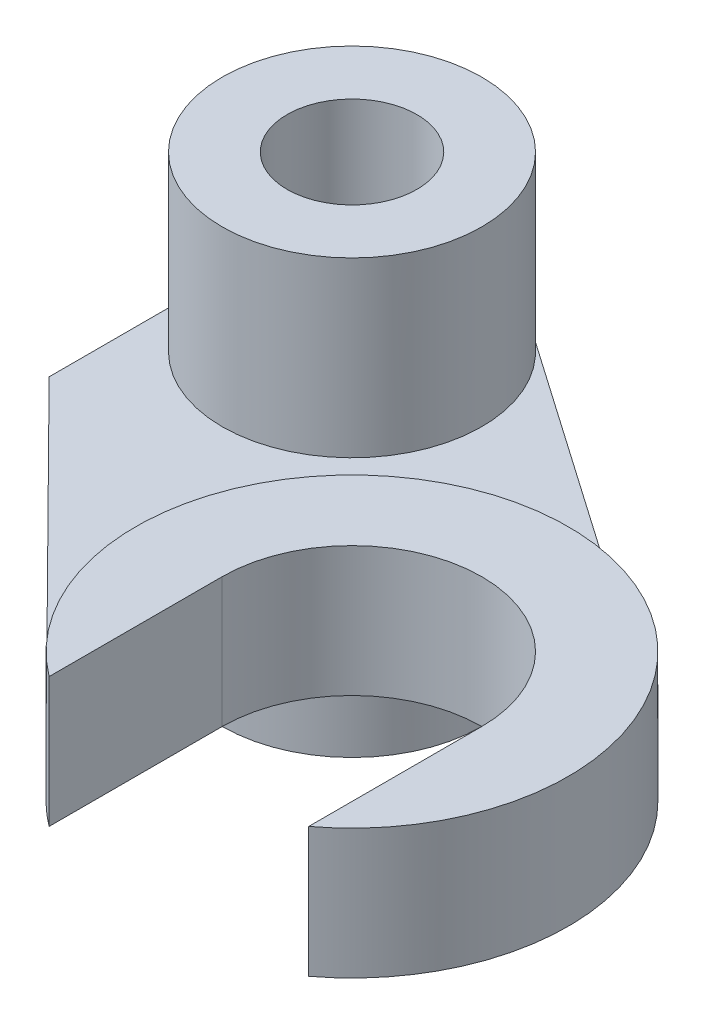
ISO-10303-21;
HEADER;
FILE_DESCRIPTION(('STEP AP214'),'2;1');
FILE_NAME('part.step','',(''),(''),'','','');
FILE_SCHEMA(('AUTOMOTIVE_DESIGN { 1 0 10303 214 1 1 1 1 }'));
ENDSEC;
DATA;
#1=APPLICATION_CONTEXT('core data for automotive mechanical design processes');
#2=APPLICATION_PROTOCOL_DEFINITION('international standard','automotive_design',2000,#1);
#3=PRODUCT_CONTEXT('',#1,'mechanical');
#4=PRODUCT('Part','Part','',(#3));
#5=PRODUCT_RELATED_PRODUCT_CATEGORY('part','',(#4));
#6=PRODUCT_DEFINITION_FORMATION('','',#4);
#7=PRODUCT_DEFINITION_CONTEXT('part definition',#1,'design');
#8=PRODUCT_DEFINITION('design','',#6,#7);
#9=PRODUCT_DEFINITION_SHAPE('','',#8);
#10=(LENGTH_UNIT() NAMED_UNIT(*) SI_UNIT(.MILLI.,.METRE.));
#11=(NAMED_UNIT(*) PLANE_ANGLE_UNIT() SI_UNIT($,.RADIAN.));
#12=(NAMED_UNIT(*) SI_UNIT($,.STERADIAN.) SOLID_ANGLE_UNIT());
#13=UNCERTAINTY_MEASURE_WITH_UNIT(LENGTH_MEASURE(1.E-05),#10,'distance_accuracy_value','');
#14=(GEOMETRIC_REPRESENTATION_CONTEXT(3) GLOBAL_UNCERTAINTY_ASSIGNED_CONTEXT((#13)) GLOBAL_UNIT_ASSIGNED_CONTEXT((#10,
#11,#12)) REPRESENTATION_CONTEXT('',''));
#15=CARTESIAN_POINT('',(0.,0.,0.));
#16=DIRECTION('',(0.,0.,1.));
#17=DIRECTION('',(1.,0.,0.));
#18=AXIS2_PLACEMENT_3D('',#15,#16,#17);
#19=CARTESIAN_POINT('',(0.,10.,0.));
#20=DIRECTION('',(0.,1.,0.));
#21=DIRECTION('',(0.,0.,1.));
#22=AXIS2_PLACEMENT_3D('',#19,#20,#21);
#23=PLANE('',#22);
#24=DIRECTION('',(0.703744946619285,0.,0.710452707861558));
#25=VECTOR('',#24,1.);
#26=CARTESIAN_POINT('',(-35.1413916220169,10.,34.8096030847739));
#27=LINE('',#26,#25);
#28=CARTESIAN_POINT('',(-30.,10.,40.));
#29=VERTEX_POINT('',#28);
#30=CARTESIAN_POINT('',(44.4773646069221,10.,115.187247330964));
#31=VERTEX_POINT('',#30);
#32=EDGE_CURVE('E124',#29,#31,#27,.T.);
#33=ORIENTED_EDGE('',*,*,#32,.T.);
#34=CARTESIAN_POINT('',(80.,10.,80.));
#35=DIRECTION('',(0.,1.,0.));
#36=DIRECTION('',(0.,0.,1.));
#37=AXIS2_PLACEMENT_3D('',#34,#35,#36);
#38=CIRCLE('',#37,50.);
#39=CARTESIAN_POINT('',(108.548527267688,10.,38.9514727323124));
#40=VERTEX_POINT('',#39);
#41=EDGE_CURVE('E206',#31,#40,#38,.F.);
#42=ORIENTED_EDGE('',*,*,#41,.T.);
#43=DIRECTION('',(0.820970545353753,0.,0.570970545353753));
#44=VECTOR('',#43,1.);
#45=CARTESIAN_POINT('',(17.1291163606126,10.,-24.6291163606126));
#46=LINE('',#45,#44);
#47=CARTESIAN_POINT('',(17.1291163606126,10.,-24.6291163606126));
#48=VERTEX_POINT('',#47);
#49=EDGE_CURVE('E116',#48,#40,#46,.T.);
#50=ORIENTED_EDGE('',*,*,#49,.F.);
#51=CARTESIAN_POINT('',(0.,10.,0.));
#52=DIRECTION('',(0.,1.,0.));
#53=DIRECTION('',(0.,0.,1.));
#54=AXIS2_PLACEMENT_3D('',#51,#52,#53);
#55=CIRCLE('',#54,30.);
#56=CARTESIAN_POINT('',(-30.,10.,0.));
#57=VERTEX_POINT('',#56);
#58=EDGE_CURVE('E113',#48,#57,#55,.F.);
#59=ORIENTED_EDGE('',*,*,#58,.T.);
#60=DIRECTION('',(0.,0.,1.));
#61=VECTOR('',#60,1.);
#62=CARTESIAN_POINT('',(-30.,10.,0.));
#63=LINE('',#62,#61);
#64=EDGE_CURVE('E63',#57,#29,#63,.T.);
#65=ORIENTED_EDGE('',*,*,#64,.T.);
#66=EDGE_LOOP('',(#33,#42,#50,#59,#65));
#67=FACE_BOUND('',#66,.T.);
#68=ADVANCED_FACE('F45',(#67),#23,.T.);
#69=CARTESIAN_POINT('',(0.,10.,0.));
#70=DIRECTION('',(0.,-1.,0.));
#71=DIRECTION('',(0.,0.,-1.));
#72=AXIS2_PLACEMENT_3D('',#69,#70,#71);
#73=CYLINDRICAL_SURFACE('',#72,30.);
#74=DIRECTION('',(0.,-1.,0.));
#75=VECTOR('',#74,1.);
#76=CARTESIAN_POINT('',(17.1291163606126,10.,-24.6291163606126));
#77=LINE('',#76,#75);
#78=CARTESIAN_POINT('',(17.1291163606126,0.,-24.6291163606126));
#79=VERTEX_POINT('',#78);
#80=EDGE_CURVE('E110',#48,#79,#77,.T.);
#81=ORIENTED_EDGE('',*,*,#80,.T.);
#82=CARTESIAN_POINT('',(0.,0.,0.));
#83=DIRECTION('',(0.,1.,0.));
#84=DIRECTION('',(0.,0.,1.));
#85=AXIS2_PLACEMENT_3D('',#82,#83,#84);
#86=CIRCLE('',#85,30.);
#87=CARTESIAN_POINT('',(-30.,0.,0.));
#88=VERTEX_POINT('',#87);
#89=EDGE_CURVE('E11',#79,#88,#86,.F.);
#90=ORIENTED_EDGE('',*,*,#89,.T.);
#91=DIRECTION('',(0.,-1.,0.));
#92=VECTOR('',#91,1.);
#93=CARTESIAN_POINT('',(-30.,10.,0.));
#94=LINE('',#93,#92);
#95=EDGE_CURVE('E55',#57,#88,#94,.T.);
#96=ORIENTED_EDGE('',*,*,#95,.F.);
#97=ORIENTED_EDGE('',*,*,#58,.F.);
#98=EDGE_LOOP('',(#81,#90,#96,#97));
#99=FACE_BOUND('',#98,.T.);
#100=CARTESIAN_POINT('',(0.,-50.,0.));
#101=DIRECTION('',(0.,1.,0.));
#102=DIRECTION('',(0.,0.,1.));
#103=AXIS2_PLACEMENT_3D('',#100,#101,#102);
#104=CIRCLE('',#103,30.);
#105=CARTESIAN_POINT('',(0.,-50.,30.));
#106=VERTEX_POINT('',#105);
#107=EDGE_CURVE('E213',#106,#106,#104,.T.);
#108=ORIENTED_EDGE('',*,*,#107,.T.);
#109=EDGE_LOOP('',(#108));
#110=FACE_BOUND('',#109,.T.);
#111=CARTESIAN_POINT('',(0.,50.,0.));
#112=DIRECTION('',(0.,1.,0.));
#113=DIRECTION('',(0.,0.,1.));
#114=AXIS2_PLACEMENT_3D('',#111,#112,#113);
#115=CIRCLE('',#114,30.);
#116=CARTESIAN_POINT('',(0.,50.,30.));
#117=VERTEX_POINT('',#116);
#118=EDGE_CURVE('E221',#117,#117,#115,.T.);
#119=ORIENTED_EDGE('',*,*,#118,.F.);
#120=EDGE_LOOP('',(#119));
#121=FACE_BOUND('',#120,.T.);
#122=ADVANCED_FACE('F111',(#99,#110,#121),#73,.T.);
#123=CARTESIAN_POINT('',(-30.,10.,0.));
#124=DIRECTION('',(1.,0.,0.));
#125=DIRECTION('',(0.,0.,-1.));
#126=AXIS2_PLACEMENT_3D('',#123,#124,#125);
#127=PLANE('',#126);
#128=DIRECTION('',(0.,0.,1.));
#129=VECTOR('',#128,1.);
#130=CARTESIAN_POINT('',(-30.,0.,0.));
#131=LINE('',#130,#129);
#132=CARTESIAN_POINT('',(-30.,0.,40.));
#133=VERTEX_POINT('',#132);
#134=EDGE_CURVE('E105',#88,#133,#131,.T.);
#135=ORIENTED_EDGE('',*,*,#134,.T.);
#136=DIRECTION('',(0.,-1.,0.));
#137=VECTOR('',#136,1.);
#138=CARTESIAN_POINT('',(-30.,10.,40.));
#139=LINE('',#138,#137);
#140=EDGE_CURVE('E151',#29,#133,#139,.T.);
#141=ORIENTED_EDGE('',*,*,#140,.F.);
#142=ORIENTED_EDGE('',*,*,#64,.F.);
#143=ORIENTED_EDGE('',*,*,#95,.T.);
#144=EDGE_LOOP('',(#135,#141,#142,#143));
#145=FACE_BOUND('',#144,.T.);
#146=ADVANCED_FACE('F157',(#145),#127,.F.);
#147=CARTESIAN_POINT('',(-35.1413916220169,10.,34.8096030847739));
#148=DIRECTION('',(0.710452707861558,0.,-0.703744946619285));
#149=DIRECTION('',(-0.703744946619285,0.,-0.710452707861558));
#150=AXIS2_PLACEMENT_3D('',#147,#148,#149);
#151=PLANE('',#150);
#152=DIRECTION('',(0.703744946619285,0.,0.710452707861558));
#153=VECTOR('',#152,1.);
#154=CARTESIAN_POINT('',(-35.1413916220169,0.,34.8096030847739));
#155=LINE('',#154,#153);
#156=CARTESIAN_POINT('',(44.4773646069221,0.,115.187247330964));
#157=VERTEX_POINT('',#156);
#158=EDGE_CURVE('E233',#133,#157,#155,.T.);
#159=ORIENTED_EDGE('',*,*,#158,.T.);
#160=DIRECTION('',(0.,-1.,0.));
#161=VECTOR('',#160,1.);
#162=CARTESIAN_POINT('',(44.4773646069221,10.,115.187247330964));
#163=LINE('',#162,#161);
#164=EDGE_CURVE('E147',#31,#157,#163,.T.);
#165=ORIENTED_EDGE('',*,*,#164,.F.);
#166=ORIENTED_EDGE('',*,*,#32,.F.);
#167=ORIENTED_EDGE('',*,*,#140,.T.);
#168=EDGE_LOOP('',(#159,#165,#166,#167));
#169=FACE_BOUND('',#168,.T.);
#170=ADVANCED_FACE('F252',(#169),#151,.F.);
#171=CARTESIAN_POINT('',(50.,10.,0.));
#172=DIRECTION('',(1.,0.,0.));
#173=DIRECTION('',(0.,0.,-1.));
#174=AXIS2_PLACEMENT_3D('',#171,#172,#173);
#175=PLANE('',#174);
#176=DIRECTION('',(0.,0.,1.));
#177=VECTOR('',#176,1.);
#178=CARTESIAN_POINT('',(50.,0.,0.));
#179=LINE('',#178,#177);
#180=CARTESIAN_POINT('',(50.,0.,80.));
#181=VERTEX_POINT('',#180);
#182=CARTESIAN_POINT('',(50.,0.,120.));
#183=VERTEX_POINT('',#182);
#184=EDGE_CURVE('E237',#181,#183,#179,.T.);
#185=ORIENTED_EDGE('',*,*,#184,.F.);
#186=DIRECTION('',(0.,-1.,0.));
#187=VECTOR('',#186,1.);
#188=CARTESIAN_POINT('',(50.,10.,80.));
#189=LINE('',#188,#187);
#190=CARTESIAN_POINT('',(50.,30.,80.));
#191=VERTEX_POINT('',#190);
#192=EDGE_CURVE('E141',#191,#181,#189,.T.);
#193=ORIENTED_EDGE('',*,*,#192,.F.);
#194=DIRECTION('',(0.,0.,1.));
#195=VECTOR('',#194,1.);
#196=CARTESIAN_POINT('',(50.,30.,0.));
#197=LINE('',#196,#195);
#198=CARTESIAN_POINT('',(50.,30.,120.));
#199=VERTEX_POINT('',#198);
#200=EDGE_CURVE('E194',#191,#199,#197,.T.);
#201=ORIENTED_EDGE('',*,*,#200,.T.);
#202=DIRECTION('',(0.,-1.,0.));
#203=VECTOR('',#202,1.);
#204=CARTESIAN_POINT('',(50.,10.,120.));
#205=LINE('',#204,#203);
#206=EDGE_CURVE('E144',#199,#183,#205,.T.);
#207=ORIENTED_EDGE('',*,*,#206,.T.);
#208=EDGE_LOOP('',(#185,#193,#201,#207));
#209=FACE_BOUND('',#208,.T.);
#210=ADVANCED_FACE('F249',(#209),#175,.T.);
#211=CARTESIAN_POINT('',(80.,10.,80.));
#212=DIRECTION('',(0.,-1.,0.));
#213=DIRECTION('',(0.,0.,-1.));
#214=AXIS2_PLACEMENT_3D('',#211,#212,#213);
#215=CYLINDRICAL_SURFACE('',#214,30.);
#216=CARTESIAN_POINT('',(80.,0.,80.));
#217=DIRECTION('',(0.,1.,0.));
#218=DIRECTION('',(0.,0.,1.));
#219=AXIS2_PLACEMENT_3D('',#216,#217,#218);
#220=CIRCLE('',#219,30.);
#221=CARTESIAN_POINT('',(110.,0.,80.));
#222=VERTEX_POINT('',#221);
#223=EDGE_CURVE('E240',#222,#181,#220,.T.);
#224=ORIENTED_EDGE('',*,*,#223,.F.);
#225=DIRECTION('',(0.,-1.,0.));
#226=VECTOR('',#225,1.);
#227=CARTESIAN_POINT('',(110.,10.,80.));
#228=LINE('',#227,#226);
#229=CARTESIAN_POINT('',(110.,30.,80.));
#230=VERTEX_POINT('',#229);
#231=EDGE_CURVE('E138',#230,#222,#228,.T.);
#232=ORIENTED_EDGE('',*,*,#231,.F.);
#233=CARTESIAN_POINT('',(80.,30.,80.));
#234=DIRECTION('',(0.,1.,0.));
#235=DIRECTION('',(0.,0.,1.));
#236=AXIS2_PLACEMENT_3D('',#233,#234,#235);
#237=CIRCLE('',#236,30.);
#238=EDGE_CURVE('E198',#230,#191,#237,.T.);
#239=ORIENTED_EDGE('',*,*,#238,.T.);
#240=ORIENTED_EDGE('',*,*,#192,.T.);
#241=EDGE_LOOP('',(#224,#232,#239,#240));
#242=FACE_BOUND('',#241,.T.);
#243=ADVANCED_FACE('F247',(#242),#215,.F.);
#244=CARTESIAN_POINT('',(110.,10.,0.));
#245=DIRECTION('',(1.,0.,0.));
#246=DIRECTION('',(0.,0.,-1.));
#247=AXIS2_PLACEMENT_3D('',#244,#245,#246);
#248=PLANE('',#247);
#249=DIRECTION('',(0.,0.,1.));
#250=VECTOR('',#249,1.);
#251=CARTESIAN_POINT('',(110.,0.,0.));
#252=LINE('',#251,#250);
#253=CARTESIAN_POINT('',(110.,0.,120.));
#254=VERTEX_POINT('',#253);
#255=EDGE_CURVE('E126',#222,#254,#252,.T.);
#256=ORIENTED_EDGE('',*,*,#255,.T.);
#257=DIRECTION('',(0.,-1.,0.));
#258=VECTOR('',#257,1.);
#259=CARTESIAN_POINT('',(110.,10.,120.));
#260=LINE('',#259,#258);
#261=CARTESIAN_POINT('',(110.,30.,120.));
#262=VERTEX_POINT('',#261);
#263=EDGE_CURVE('E134',#262,#254,#260,.T.);
#264=ORIENTED_EDGE('',*,*,#263,.F.);
#265=DIRECTION('',(0.,0.,1.));
#266=VECTOR('',#265,1.);
#267=CARTESIAN_POINT('',(110.,30.,0.));
#268=LINE('',#267,#266);
#269=EDGE_CURVE('E182',#230,#262,#268,.T.);
#270=ORIENTED_EDGE('',*,*,#269,.F.);
#271=ORIENTED_EDGE('',*,*,#231,.T.);
#272=EDGE_LOOP('',(#256,#264,#270,#271));
#273=FACE_BOUND('',#272,.T.);
#274=ADVANCED_FACE('F180',(#273),#248,.F.);
#275=CARTESIAN_POINT('',(80.,10.,80.));
#276=DIRECTION('',(0.,-1.,0.));
#277=DIRECTION('',(0.,0.,-1.));
#278=AXIS2_PLACEMENT_3D('',#275,#276,#277);
#279=CYLINDRICAL_SURFACE('',#278,50.);
#280=CARTESIAN_POINT('',(80.,0.,80.));
#281=DIRECTION('',(0.,1.,0.));
#282=DIRECTION('',(0.,0.,1.));
#283=AXIS2_PLACEMENT_3D('',#280,#281,#282);
#284=CIRCLE('',#283,50.);
#285=CARTESIAN_POINT('',(108.548527267688,0.,38.9514727323124));
#286=VERTEX_POINT('',#285);
#287=EDGE_CURVE('E120',#254,#286,#284,.T.);
#288=ORIENTED_EDGE('',*,*,#287,.T.);
#289=DIRECTION('',(0.,-1.,0.));
#290=VECTOR('',#289,1.);
#291=CARTESIAN_POINT('',(108.548527267688,10.,38.9514727323124));
#292=LINE('',#291,#290);
#293=EDGE_CURVE('E92',#40,#286,#292,.T.);
#294=ORIENTED_EDGE('',*,*,#293,.F.);
#295=ORIENTED_EDGE('',*,*,#41,.F.);
#296=ORIENTED_EDGE('',*,*,#164,.T.);
#297=EDGE_CURVE('E128',#157,#183,#284,.T.);
#298=ORIENTED_EDGE('',*,*,#297,.T.);
#299=ORIENTED_EDGE('',*,*,#206,.F.);
#300=CARTESIAN_POINT('',(80.,30.,80.));
#301=DIRECTION('',(0.,1.,0.));
#302=DIRECTION('',(0.,0.,1.));
#303=AXIS2_PLACEMENT_3D('',#300,#301,#302);
#304=CIRCLE('',#303,50.);
#305=EDGE_CURVE('E187',#262,#199,#304,.T.);
#306=ORIENTED_EDGE('',*,*,#305,.F.);
#307=ORIENTED_EDGE('',*,*,#263,.T.);
#308=EDGE_LOOP('',(#288,#294,#295,#296,#298,#299,#306,#307));
#309=FACE_BOUND('',#308,.T.);
#310=ADVANCED_FACE('F188',(#309),#279,.T.);
#311=CARTESIAN_POINT('',(17.1291163606126,10.,-24.6291163606126));
#312=DIRECTION('',(0.570970545353753,0.,-0.820970545353753));
#313=DIRECTION('',(-0.820970545353753,0.,-0.570970545353753));
#314=AXIS2_PLACEMENT_3D('',#311,#312,#313);
#315=PLANE('',#314);
#316=DIRECTION('',(0.820970545353753,0.,0.570970545353753));
#317=VECTOR('',#316,1.);
#318=CARTESIAN_POINT('',(17.1291163606126,0.,-24.6291163606126));
#319=LINE('',#318,#317);
#320=EDGE_CURVE('E102',#79,#286,#319,.T.);
#321=ORIENTED_EDGE('',*,*,#320,.F.);
#322=ORIENTED_EDGE('',*,*,#80,.F.);
#323=ORIENTED_EDGE('',*,*,#49,.T.);
#324=ORIENTED_EDGE('',*,*,#293,.T.);
#325=EDGE_LOOP('',(#321,#322,#323,#324));
#326=FACE_BOUND('',#325,.T.);
#327=ADVANCED_FACE('F118',(#326),#315,.T.);
#328=CARTESIAN_POINT('',(0.,0.,0.));
#329=DIRECTION('',(0.,1.,0.));
#330=DIRECTION('',(0.,0.,1.));
#331=AXIS2_PLACEMENT_3D('',#328,#329,#330);
#332=PLANE('',#331);
#333=ORIENTED_EDGE('',*,*,#297,.F.);
#334=ORIENTED_EDGE('',*,*,#158,.F.);
#335=ORIENTED_EDGE('',*,*,#134,.F.);
#336=ORIENTED_EDGE('',*,*,#89,.F.);
#337=ORIENTED_EDGE('',*,*,#320,.T.);
#338=ORIENTED_EDGE('',*,*,#287,.F.);
#339=ORIENTED_EDGE('',*,*,#255,.F.);
#340=ORIENTED_EDGE('',*,*,#223,.T.);
#341=ORIENTED_EDGE('',*,*,#184,.T.);
#342=EDGE_LOOP('',(#333,#334,#335,#336,#337,#338,#339,#340,#341));
#343=FACE_BOUND('',#342,.T.);
#344=ADVANCED_FACE('F100',(#343),#332,.F.);
#345=CARTESIAN_POINT('',(0.,-50.,0.));
#346=DIRECTION('',(0.,1.,0.));
#347=DIRECTION('',(0.,0.,1.));
#348=AXIS2_PLACEMENT_3D('',#345,#346,#347);
#349=PLANE('',#348);
#350=CARTESIAN_POINT('',(0.,-50.,0.));
#351=DIRECTION('',(0.,1.,0.));
#352=DIRECTION('',(0.,0.,1.));
#353=AXIS2_PLACEMENT_3D('',#350,#351,#352);
#354=CIRCLE('',#353,15.);
#355=CARTESIAN_POINT('',(0.,-50.,15.));
#356=VERTEX_POINT('',#355);
#357=EDGE_CURVE('E209',#356,#356,#354,.T.);
#358=ORIENTED_EDGE('',*,*,#357,.T.);
#359=EDGE_LOOP('',(#358));
#360=FACE_BOUND('',#359,.T.);
#361=ORIENTED_EDGE('',*,*,#107,.F.);
#362=EDGE_LOOP('',(#361));
#363=FACE_BOUND('',#362,.T.);
#364=ADVANCED_FACE('F265',(#360,#363),#349,.F.);
#365=CARTESIAN_POINT('',(0.,10.,0.));
#366=DIRECTION('',(0.,-1.,0.));
#367=DIRECTION('',(0.,0.,-1.));
#368=AXIS2_PLACEMENT_3D('',#365,#366,#367);
#369=CYLINDRICAL_SURFACE('',#368,15.);
#370=ORIENTED_EDGE('',*,*,#357,.F.);
#371=EDGE_LOOP('',(#370));
#372=FACE_BOUND('',#371,.T.);
#373=CARTESIAN_POINT('',(0.,50.,0.));
#374=DIRECTION('',(0.,1.,0.));
#375=DIRECTION('',(0.,0.,1.));
#376=AXIS2_PLACEMENT_3D('',#373,#374,#375);
#377=CIRCLE('',#376,15.);
#378=CARTESIAN_POINT('',(0.,50.,15.));
#379=VERTEX_POINT('',#378);
#380=EDGE_CURVE('E217',#379,#379,#377,.T.);
#381=ORIENTED_EDGE('',*,*,#380,.T.);
#382=EDGE_LOOP('',(#381));
#383=FACE_BOUND('',#382,.T.);
#384=ADVANCED_FACE('F47',(#372,#383),#369,.F.);
#385=CARTESIAN_POINT('',(0.,50.,0.));
#386=DIRECTION('',(0.,1.,0.));
#387=DIRECTION('',(0.,0.,1.));
#388=AXIS2_PLACEMENT_3D('',#385,#386,#387);
#389=PLANE('',#388);
#390=ORIENTED_EDGE('',*,*,#380,.F.);
#391=EDGE_LOOP('',(#390));
#392=FACE_BOUND('',#391,.T.);
#393=ORIENTED_EDGE('',*,*,#118,.T.);
#394=EDGE_LOOP('',(#393));
#395=FACE_BOUND('',#394,.T.);
#396=ADVANCED_FACE('F261',(#392,#395),#389,.T.);
#397=CARTESIAN_POINT('',(0.,30.,0.));
#398=DIRECTION('',(0.,1.,0.));
#399=DIRECTION('',(0.,0.,1.));
#400=AXIS2_PLACEMENT_3D('',#397,#398,#399);
#401=PLANE('',#400);
#402=ORIENTED_EDGE('',*,*,#269,.T.);
#403=ORIENTED_EDGE('',*,*,#305,.T.);
#404=ORIENTED_EDGE('',*,*,#200,.F.);
#405=ORIENTED_EDGE('',*,*,#238,.F.);
#406=EDGE_LOOP('',(#402,#403,#404,#405));
#407=FACE_BOUND('',#406,.T.);
#408=ADVANCED_FACE('F196',(#407),#401,.T.);
#409=CLOSED_SHELL('',(#68,#122,#146,#170,#210,#243,#274,#310,#327,#344,#364,#384,#396,#408));
#410=MANIFOLD_SOLID_BREP('B2',#409);
#411=ADVANCED_BREP_SHAPE_REPRESENTATION('',(#18,#410),#14);
#412=SHAPE_DEFINITION_REPRESENTATION(#9,#411);
ENDSEC;
END-ISO-10303-21;
